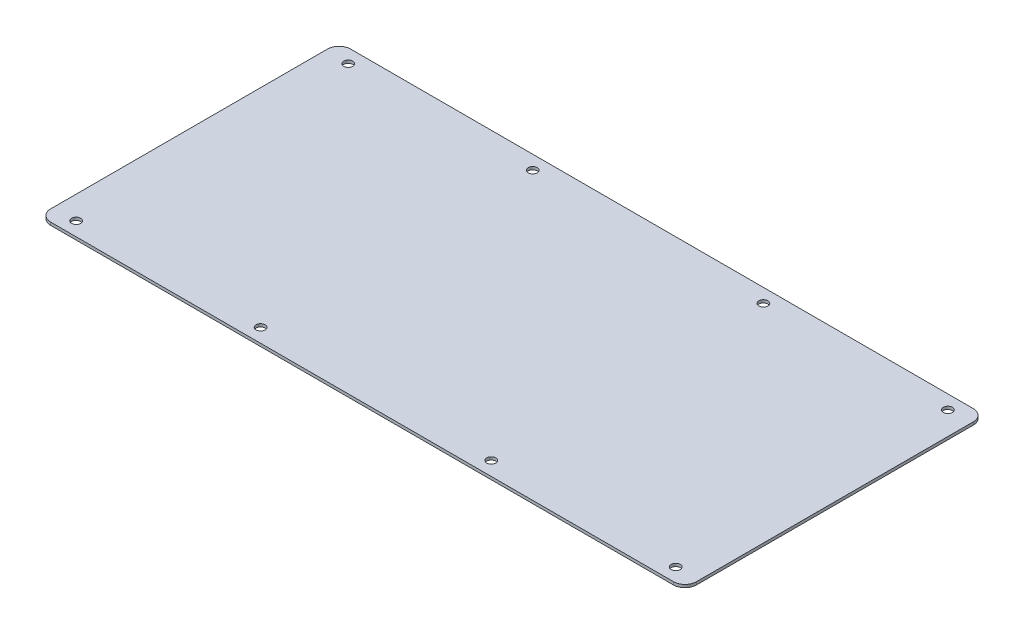
ISO-10303-21;
HEADER;
FILE_DESCRIPTION(('STEP AP214'),'2;1');
FILE_NAME('part.step','',(''),(''),'','','');
FILE_SCHEMA(('AUTOMOTIVE_DESIGN { 1 0 10303 214 1 1 1 1 }'));
ENDSEC;
DATA;
#1=APPLICATION_CONTEXT('core data for automotive mechanical design processes');
#2=APPLICATION_PROTOCOL_DEFINITION('international standard','automotive_design',2000,#1);
#3=PRODUCT_CONTEXT('',#1,'mechanical');
#4=PRODUCT('Part','Part','',(#3));
#5=PRODUCT_RELATED_PRODUCT_CATEGORY('part','',(#4));
#6=PRODUCT_DEFINITION_FORMATION('','',#4);
#7=PRODUCT_DEFINITION_CONTEXT('part definition',#1,'design');
#8=PRODUCT_DEFINITION('design','',#6,#7);
#9=PRODUCT_DEFINITION_SHAPE('','',#8);
#10=(LENGTH_UNIT() NAMED_UNIT(*) SI_UNIT(.MILLI.,.METRE.));
#11=(NAMED_UNIT(*) PLANE_ANGLE_UNIT() SI_UNIT($,.RADIAN.));
#12=(NAMED_UNIT(*) SI_UNIT($,.STERADIAN.) SOLID_ANGLE_UNIT());
#13=UNCERTAINTY_MEASURE_WITH_UNIT(LENGTH_MEASURE(1.E-05),#10,'distance_accuracy_value','');
#14=(GEOMETRIC_REPRESENTATION_CONTEXT(3) GLOBAL_UNCERTAINTY_ASSIGNED_CONTEXT((#13)) GLOBAL_UNIT_ASSIGNED_CONTEXT((#10,
#11,#12)) REPRESENTATION_CONTEXT('',''));
#15=CARTESIAN_POINT('',(0.,0.,0.));
#16=DIRECTION('',(0.,0.,1.));
#17=DIRECTION('',(1.,0.,0.));
#18=AXIS2_PLACEMENT_3D('',#15,#16,#17);
#19=CARTESIAN_POINT('',(0.,1.5875,0.));
#20=DIRECTION('',(1.,0.,0.));
#21=DIRECTION('',(0.,0.,-1.));
#22=AXIS2_PLACEMENT_3D('',#19,#20,#21);
#23=PLANE('',#22);
#24=DIRECTION('',(0.,0.,1.));
#25=VECTOR('',#24,1.);
#26=CARTESIAN_POINT('',(0.,1.5875,0.));
#27=LINE('',#26,#25);
#28=CARTESIAN_POINT('',(0.,1.5875,-158.75));
#29=VERTEX_POINT('',#28);
#30=CARTESIAN_POINT('',(0.,1.5875,-6.35));
#31=VERTEX_POINT('',#30);
#32=EDGE_CURVE('E118',#29,#31,#27,.T.);
#33=ORIENTED_EDGE('',*,*,#32,.F.);
#34=DIRECTION('',(0.,-1.,0.));
#35=VECTOR('',#34,1.);
#36=CARTESIAN_POINT('',(0.,1.5875,-158.75));
#37=LINE('',#36,#35);
#38=CARTESIAN_POINT('',(0.,0.,-158.75));
#39=VERTEX_POINT('',#38);
#40=EDGE_CURVE('E103',#29,#39,#37,.T.);
#41=ORIENTED_EDGE('',*,*,#40,.T.);
#42=DIRECTION('',(0.,0.,1.));
#43=VECTOR('',#42,1.);
#44=CARTESIAN_POINT('',(0.,0.,0.));
#45=LINE('',#44,#43);
#46=CARTESIAN_POINT('',(0.,0.,-6.35));
#47=VERTEX_POINT('',#46);
#48=EDGE_CURVE('E115',#39,#47,#45,.T.);
#49=ORIENTED_EDGE('',*,*,#48,.T.);
#50=DIRECTION('',(0.,-1.,0.));
#51=VECTOR('',#50,1.);
#52=CARTESIAN_POINT('',(0.,1.5875,-6.35));
#53=LINE('',#52,#51);
#54=EDGE_CURVE('E120',#47,#31,#53,.F.);
#55=ORIENTED_EDGE('',*,*,#54,.T.);
#56=EDGE_LOOP('',(#33,#41,#49,#55));
#57=FACE_BOUND('',#56,.T.);
#58=ADVANCED_FACE('F33',(#57),#23,.F.);
#59=CARTESIAN_POINT('',(0.,1.5875,0.));
#60=DIRECTION('',(0.,0.,-1.));
#61=DIRECTION('',(-1.,0.,0.));
#62=AXIS2_PLACEMENT_3D('',#59,#60,#61);
#63=PLANE('',#62);
#64=DIRECTION('',(1.,0.,0.));
#65=VECTOR('',#64,1.);
#66=CARTESIAN_POINT('',(0.,0.,0.));
#67=LINE('',#66,#65);
#68=CARTESIAN_POINT('',(6.35,0.,0.));
#69=VERTEX_POINT('',#68);
#70=CARTESIAN_POINT('',(349.25,0.,0.));
#71=VERTEX_POINT('',#70);
#72=EDGE_CURVE('E124',#69,#71,#67,.T.);
#73=ORIENTED_EDGE('',*,*,#72,.T.);
#74=DIRECTION('',(0.,-1.,0.));
#75=VECTOR('',#74,1.);
#76=CARTESIAN_POINT('',(349.25,1.5875,0.));
#77=LINE('',#76,#75);
#78=CARTESIAN_POINT('',(349.25,1.5875,0.));
#79=VERTEX_POINT('',#78);
#80=EDGE_CURVE('E11',#71,#79,#77,.F.);
#81=ORIENTED_EDGE('',*,*,#80,.T.);
#82=DIRECTION('',(1.,0.,0.));
#83=VECTOR('',#82,1.);
#84=CARTESIAN_POINT('',(0.,1.5875,0.));
#85=LINE('',#84,#83);
#86=CARTESIAN_POINT('',(6.35,1.5875,0.));
#87=VERTEX_POINT('',#86);
#88=EDGE_CURVE('E164',#87,#79,#85,.T.);
#89=ORIENTED_EDGE('',*,*,#88,.F.);
#90=DIRECTION('',(0.,-1.,0.));
#91=VECTOR('',#90,1.);
#92=CARTESIAN_POINT('',(6.35,1.5875,0.));
#93=LINE('',#92,#91);
#94=EDGE_CURVE('E41',#87,#69,#93,.T.);
#95=ORIENTED_EDGE('',*,*,#94,.T.);
#96=EDGE_LOOP('',(#73,#81,#89,#95));
#97=FACE_BOUND('',#96,.T.);
#98=ADVANCED_FACE('F162',(#97),#63,.F.);
#99=CARTESIAN_POINT('',(355.6,1.5875,0.));
#100=DIRECTION('',(-1.,0.,0.));
#101=DIRECTION('',(0.,0.,1.));
#102=AXIS2_PLACEMENT_3D('',#99,#100,#101);
#103=PLANE('',#102);
#104=DIRECTION('',(0.,0.,-1.));
#105=VECTOR('',#104,1.);
#106=CARTESIAN_POINT('',(355.6,0.,0.));
#107=LINE('',#106,#105);
#108=CARTESIAN_POINT('',(355.6,0.,-6.35));
#109=VERTEX_POINT('',#108);
#110=CARTESIAN_POINT('',(355.6,0.,-158.75));
#111=VERTEX_POINT('',#110);
#112=EDGE_CURVE('E128',#109,#111,#107,.T.);
#113=ORIENTED_EDGE('',*,*,#112,.T.);
#114=DIRECTION('',(0.,-1.,0.));
#115=VECTOR('',#114,1.);
#116=CARTESIAN_POINT('',(355.6,1.5875,-158.75));
#117=LINE('',#116,#115);
#118=CARTESIAN_POINT('',(355.6,1.5875,-158.75));
#119=VERTEX_POINT('',#118);
#120=EDGE_CURVE('E48',#111,#119,#117,.F.);
#121=ORIENTED_EDGE('',*,*,#120,.T.);
#122=DIRECTION('',(0.,0.,-1.));
#123=VECTOR('',#122,1.);
#124=CARTESIAN_POINT('',(355.6,1.5875,0.));
#125=LINE('',#124,#123);
#126=CARTESIAN_POINT('',(355.6,1.5875,-6.35));
#127=VERTEX_POINT('',#126);
#128=EDGE_CURVE('E172',#127,#119,#125,.T.);
#129=ORIENTED_EDGE('',*,*,#128,.F.);
#130=DIRECTION('',(0.,-1.,0.));
#131=VECTOR('',#130,1.);
#132=CARTESIAN_POINT('',(355.6,1.5875,-6.35));
#133=LINE('',#132,#131);
#134=EDGE_CURVE('E155',#127,#109,#133,.T.);
#135=ORIENTED_EDGE('',*,*,#134,.T.);
#136=EDGE_LOOP('',(#113,#121,#129,#135));
#137=FACE_BOUND('',#136,.T.);
#138=ADVANCED_FACE('F171',(#137),#103,.F.);
#139=CARTESIAN_POINT('',(0.,1.5875,-165.1));
#140=DIRECTION('',(0.,0.,1.));
#141=DIRECTION('',(1.,0.,0.));
#142=AXIS2_PLACEMENT_3D('',#139,#140,#141);
#143=PLANE('',#142);
#144=DIRECTION('',(-1.,0.,0.));
#145=VECTOR('',#144,1.);
#146=CARTESIAN_POINT('',(0.,0.,-165.1));
#147=LINE('',#146,#145);
#148=CARTESIAN_POINT('',(349.25,0.,-165.1));
#149=VERTEX_POINT('',#148);
#150=CARTESIAN_POINT('',(6.35,0.,-165.1));
#151=VERTEX_POINT('',#150);
#152=EDGE_CURVE('E138',#149,#151,#147,.T.);
#153=ORIENTED_EDGE('',*,*,#152,.T.);
#154=DIRECTION('',(0.,-1.,0.));
#155=VECTOR('',#154,1.);
#156=CARTESIAN_POINT('',(6.35,1.5875,-165.1));
#157=LINE('',#156,#155);
#158=CARTESIAN_POINT('',(6.35,1.5875,-165.1));
#159=VERTEX_POINT('',#158);
#160=EDGE_CURVE('E104',#151,#159,#157,.F.);
#161=ORIENTED_EDGE('',*,*,#160,.T.);
#162=DIRECTION('',(-1.,0.,0.));
#163=VECTOR('',#162,1.);
#164=CARTESIAN_POINT('',(0.,1.5875,-165.1));
#165=LINE('',#164,#163);
#166=CARTESIAN_POINT('',(349.25,1.5875,-165.1));
#167=VERTEX_POINT('',#166);
#168=EDGE_CURVE('E134',#167,#159,#165,.T.);
#169=ORIENTED_EDGE('',*,*,#168,.F.);
#170=DIRECTION('',(0.,-1.,0.));
#171=VECTOR('',#170,1.);
#172=CARTESIAN_POINT('',(349.25,1.5875,-165.1));
#173=LINE('',#172,#171);
#174=EDGE_CURVE('E109',#167,#149,#173,.T.);
#175=ORIENTED_EDGE('',*,*,#174,.T.);
#176=EDGE_LOOP('',(#153,#161,#169,#175));
#177=FACE_BOUND('',#176,.T.);
#178=ADVANCED_FACE('F236',(#177),#143,.F.);
#179=CARTESIAN_POINT('',(0.,1.5875,0.));
#180=DIRECTION('',(0.,-1.,0.));
#181=DIRECTION('',(0.,0.,-1.));
#182=AXIS2_PLACEMENT_3D('',#179,#180,#181);
#183=PLANE('',#182);
#184=CARTESIAN_POINT('',(114.3,1.5875,-7.62));
#185=DIRECTION('',(0.,1.,0.));
#186=DIRECTION('',(0.,0.,1.));
#187=AXIS2_PLACEMENT_3D('',#184,#185,#186);
#188=CIRCLE('',#187,2.4892);
#189=CARTESIAN_POINT('',(114.3,1.5875,-5.13079999999999));
#190=VERTEX_POINT('',#189);
#191=EDGE_CURVE('E193',#190,#190,#188,.T.);
#192=ORIENTED_EDGE('',*,*,#191,.F.);
#193=EDGE_LOOP('',(#192));
#194=FACE_BOUND('',#193,.T.);
#195=CARTESIAN_POINT('',(241.3,1.5875,-7.62));
#196=DIRECTION('',(0.,1.,0.));
#197=DIRECTION('',(0.,0.,1.));
#198=AXIS2_PLACEMENT_3D('',#195,#196,#197);
#199=CIRCLE('',#198,2.4892);
#200=CARTESIAN_POINT('',(241.3,1.5875,-5.1308));
#201=VERTEX_POINT('',#200);
#202=EDGE_CURVE('E200',#201,#201,#199,.T.);
#203=ORIENTED_EDGE('',*,*,#202,.F.);
#204=EDGE_LOOP('',(#203));
#205=FACE_BOUND('',#204,.T.);
#206=CARTESIAN_POINT('',(241.3,1.5875,-157.48));
#207=DIRECTION('',(0.,1.,0.));
#208=DIRECTION('',(0.,0.,-1.));
#209=AXIS2_PLACEMENT_3D('',#206,#207,#208);
#210=CIRCLE('',#209,2.4892);
#211=CARTESIAN_POINT('',(241.3,1.5875,-159.9692));
#212=VERTEX_POINT('',#211);
#213=EDGE_CURVE('E181',#212,#212,#210,.T.);
#214=ORIENTED_EDGE('',*,*,#213,.F.);
#215=EDGE_LOOP('',(#214));
#216=FACE_BOUND('',#215,.T.);
#217=CARTESIAN_POINT('',(342.9,1.5875,-7.62));
#218=DIRECTION('',(0.,1.,0.));
#219=DIRECTION('',(0.,0.,1.));
#220=AXIS2_PLACEMENT_3D('',#217,#218,#219);
#221=CIRCLE('',#220,2.48919999999995);
#222=CARTESIAN_POINT('',(342.9,1.5875,-5.13080000000005));
#223=VERTEX_POINT('',#222);
#224=EDGE_CURVE('E188',#223,#223,#221,.T.);
#225=ORIENTED_EDGE('',*,*,#224,.F.);
#226=EDGE_LOOP('',(#225));
#227=FACE_BOUND('',#226,.T.);
#228=CARTESIAN_POINT('',(114.3,1.5875,-157.48));
#229=DIRECTION('',(0.,1.,0.));
#230=DIRECTION('',(0.,0.,-1.));
#231=AXIS2_PLACEMENT_3D('',#228,#229,#230);
#232=CIRCLE('',#231,2.48920000000001);
#233=CARTESIAN_POINT('',(114.3,1.5875,-159.9692));
#234=VERTEX_POINT('',#233);
#235=EDGE_CURVE('E217',#234,#234,#232,.T.);
#236=ORIENTED_EDGE('',*,*,#235,.F.);
#237=EDGE_LOOP('',(#236));
#238=FACE_BOUND('',#237,.T.);
#239=CARTESIAN_POINT('',(342.9,1.5875,-157.48));
#240=DIRECTION('',(0.,1.,0.));
#241=DIRECTION('',(0.,0.,-1.));
#242=AXIS2_PLACEMENT_3D('',#239,#240,#241);
#243=CIRCLE('',#242,2.48919999999995);
#244=CARTESIAN_POINT('',(342.9,1.5875,-159.9692));
#245=VERTEX_POINT('',#244);
#246=EDGE_CURVE('E211',#245,#245,#243,.T.);
#247=ORIENTED_EDGE('',*,*,#246,.F.);
#248=EDGE_LOOP('',(#247));
#249=FACE_BOUND('',#248,.T.);
#250=CARTESIAN_POINT('',(12.7,1.5875,-157.48));
#251=DIRECTION('',(0.,1.,0.));
#252=DIRECTION('',(0.,0.,-1.));
#253=AXIS2_PLACEMENT_3D('',#250,#251,#252);
#254=CIRCLE('',#253,2.4892);
#255=CARTESIAN_POINT('',(12.7,1.5875,-159.9692));
#256=VERTEX_POINT('',#255);
#257=EDGE_CURVE('E205',#256,#256,#254,.T.);
#258=ORIENTED_EDGE('',*,*,#257,.F.);
#259=EDGE_LOOP('',(#258));
#260=FACE_BOUND('',#259,.T.);
#261=CARTESIAN_POINT('',(12.7,1.5875,-7.61999999999999));
#262=DIRECTION('',(0.,1.,0.));
#263=DIRECTION('',(0.,0.,1.));
#264=AXIS2_PLACEMENT_3D('',#261,#262,#263);
#265=CIRCLE('',#264,2.4892);
#266=CARTESIAN_POINT('',(12.7,1.5875,-5.13079999999999));
#267=VERTEX_POINT('',#266);
#268=EDGE_CURVE('E131',#267,#267,#265,.T.);
#269=ORIENTED_EDGE('',*,*,#268,.F.);
#270=EDGE_LOOP('',(#269));
#271=FACE_BOUND('',#270,.T.);
#272=ORIENTED_EDGE('',*,*,#168,.T.);
#273=CARTESIAN_POINT('',(6.35,1.5875,-158.75));
#274=DIRECTION('',(0.,-1.,0.));
#275=DIRECTION('',(0.,0.,-1.));
#276=AXIS2_PLACEMENT_3D('',#273,#274,#275);
#277=CIRCLE('',#276,6.35);
#278=EDGE_CURVE('E153',#159,#29,#277,.F.);
#279=ORIENTED_EDGE('',*,*,#278,.T.);
#280=ORIENTED_EDGE('',*,*,#32,.T.);
#281=CARTESIAN_POINT('',(6.35,1.5875,-6.35));
#282=DIRECTION('',(0.,-1.,0.));
#283=DIRECTION('',(0.,0.,-1.));
#284=AXIS2_PLACEMENT_3D('',#281,#282,#283);
#285=CIRCLE('',#284,6.35);
#286=EDGE_CURVE('E148',#31,#87,#285,.F.);
#287=ORIENTED_EDGE('',*,*,#286,.T.);
#288=ORIENTED_EDGE('',*,*,#88,.T.);
#289=CARTESIAN_POINT('',(349.25,1.5875,-6.35));
#290=DIRECTION('',(0.,-1.,0.));
#291=DIRECTION('',(0.,0.,-1.));
#292=AXIS2_PLACEMENT_3D('',#289,#290,#291);
#293=CIRCLE('',#292,6.35);
#294=EDGE_CURVE('E55',#79,#127,#293,.F.);
#295=ORIENTED_EDGE('',*,*,#294,.T.);
#296=ORIENTED_EDGE('',*,*,#128,.T.);
#297=CARTESIAN_POINT('',(349.25,1.5875,-158.75));
#298=DIRECTION('',(0.,-1.,0.));
#299=DIRECTION('',(0.,0.,-1.));
#300=AXIS2_PLACEMENT_3D('',#297,#298,#299);
#301=CIRCLE('',#300,6.35);
#302=EDGE_CURVE('E151',#119,#167,#301,.F.);
#303=ORIENTED_EDGE('',*,*,#302,.T.);
#304=EDGE_LOOP('',(#272,#279,#280,#287,#288,#295,#296,#303));
#305=FACE_BOUND('',#304,.T.);
#306=ADVANCED_FACE('F233',(#194,#205,#216,#227,#238,#249,#260,#271,#305),#183,.F.);
#307=CARTESIAN_POINT('',(0.,0.,0.));
#308=DIRECTION('',(0.,-1.,0.));
#309=DIRECTION('',(0.,0.,-1.));
#310=AXIS2_PLACEMENT_3D('',#307,#308,#309);
#311=PLANE('',#310);
#312=CARTESIAN_POINT('',(114.3,0.,-7.62));
#313=DIRECTION('',(0.,1.,0.));
#314=DIRECTION('',(0.,0.,1.));
#315=AXIS2_PLACEMENT_3D('',#312,#313,#314);
#316=CIRCLE('',#315,2.4892);
#317=CARTESIAN_POINT('',(114.3,0.,-5.13079999999999));
#318=VERTEX_POINT('',#317);
#319=EDGE_CURVE('E196',#318,#318,#316,.T.);
#320=ORIENTED_EDGE('',*,*,#319,.T.);
#321=EDGE_LOOP('',(#320));
#322=FACE_BOUND('',#321,.T.);
#323=CARTESIAN_POINT('',(241.3,0.,-7.62));
#324=DIRECTION('',(0.,1.,0.));
#325=DIRECTION('',(0.,0.,1.));
#326=AXIS2_PLACEMENT_3D('',#323,#324,#325);
#327=CIRCLE('',#326,2.4892);
#328=CARTESIAN_POINT('',(241.3,0.,-5.1308));
#329=VERTEX_POINT('',#328);
#330=EDGE_CURVE('E185',#329,#329,#327,.T.);
#331=ORIENTED_EDGE('',*,*,#330,.T.);
#332=EDGE_LOOP('',(#331));
#333=FACE_BOUND('',#332,.T.);
#334=CARTESIAN_POINT('',(241.3,0.,-157.48));
#335=DIRECTION('',(0.,1.,0.));
#336=DIRECTION('',(0.,0.,-1.));
#337=AXIS2_PLACEMENT_3D('',#334,#335,#336);
#338=CIRCLE('',#337,2.4892);
#339=CARTESIAN_POINT('',(241.3,0.,-159.9692));
#340=VERTEX_POINT('',#339);
#341=EDGE_CURVE('E184',#340,#340,#338,.T.);
#342=ORIENTED_EDGE('',*,*,#341,.T.);
#343=EDGE_LOOP('',(#342));
#344=FACE_BOUND('',#343,.T.);
#345=CARTESIAN_POINT('',(342.9,0.,-7.62));
#346=DIRECTION('',(0.,1.,0.));
#347=DIRECTION('',(0.,0.,1.));
#348=AXIS2_PLACEMENT_3D('',#345,#346,#347);
#349=CIRCLE('',#348,2.48919999999995);
#350=CARTESIAN_POINT('',(342.9,0.,-5.13080000000005));
#351=VERTEX_POINT('',#350);
#352=EDGE_CURVE('E179',#351,#351,#349,.T.);
#353=ORIENTED_EDGE('',*,*,#352,.T.);
#354=EDGE_LOOP('',(#353));
#355=FACE_BOUND('',#354,.T.);
#356=CARTESIAN_POINT('',(114.3,0.,-157.48));
#357=DIRECTION('',(0.,1.,0.));
#358=DIRECTION('',(0.,0.,-1.));
#359=AXIS2_PLACEMENT_3D('',#356,#357,#358);
#360=CIRCLE('',#359,2.48920000000001);
#361=CARTESIAN_POINT('',(114.3,0.,-159.9692));
#362=VERTEX_POINT('',#361);
#363=EDGE_CURVE('E197',#362,#362,#360,.T.);
#364=ORIENTED_EDGE('',*,*,#363,.T.);
#365=EDGE_LOOP('',(#364));
#366=FACE_BOUND('',#365,.T.);
#367=CARTESIAN_POINT('',(342.9,0.,-157.48));
#368=DIRECTION('',(0.,1.,0.));
#369=DIRECTION('',(0.,0.,-1.));
#370=AXIS2_PLACEMENT_3D('',#367,#368,#369);
#371=CIRCLE('',#370,2.48919999999995);
#372=CARTESIAN_POINT('',(342.9,0.,-159.9692));
#373=VERTEX_POINT('',#372);
#374=EDGE_CURVE('E214',#373,#373,#371,.T.);
#375=ORIENTED_EDGE('',*,*,#374,.T.);
#376=EDGE_LOOP('',(#375));
#377=FACE_BOUND('',#376,.T.);
#378=CARTESIAN_POINT('',(12.7,0.,-157.48));
#379=DIRECTION('',(0.,1.,0.));
#380=DIRECTION('',(0.,0.,-1.));
#381=AXIS2_PLACEMENT_3D('',#378,#379,#380);
#382=CIRCLE('',#381,2.4892);
#383=CARTESIAN_POINT('',(12.7,0.,-159.9692));
#384=VERTEX_POINT('',#383);
#385=EDGE_CURVE('E208',#384,#384,#382,.T.);
#386=ORIENTED_EDGE('',*,*,#385,.T.);
#387=EDGE_LOOP('',(#386));
#388=FACE_BOUND('',#387,.T.);
#389=CARTESIAN_POINT('',(12.7,0.,-7.61999999999999));
#390=DIRECTION('',(0.,1.,0.));
#391=DIRECTION('',(0.,0.,1.));
#392=AXIS2_PLACEMENT_3D('',#389,#390,#391);
#393=CIRCLE('',#392,2.4892);
#394=CARTESIAN_POINT('',(12.7,0.,-5.13079999999999));
#395=VERTEX_POINT('',#394);
#396=EDGE_CURVE('E125',#395,#395,#393,.T.);
#397=ORIENTED_EDGE('',*,*,#396,.T.);
#398=EDGE_LOOP('',(#397));
#399=FACE_BOUND('',#398,.T.);
#400=ORIENTED_EDGE('',*,*,#48,.F.);
#401=CARTESIAN_POINT('',(6.35,0.,-158.75));
#402=DIRECTION('',(0.,-1.,0.));
#403=DIRECTION('',(0.,0.,-1.));
#404=AXIS2_PLACEMENT_3D('',#401,#402,#403);
#405=CIRCLE('',#404,6.35);
#406=EDGE_CURVE('E99',#39,#151,#405,.T.);
#407=ORIENTED_EDGE('',*,*,#406,.T.);
#408=ORIENTED_EDGE('',*,*,#152,.F.);
#409=CARTESIAN_POINT('',(349.25,0.,-158.75));
#410=DIRECTION('',(0.,-1.,0.));
#411=DIRECTION('',(0.,0.,-1.));
#412=AXIS2_PLACEMENT_3D('',#409,#410,#411);
#413=CIRCLE('',#412,6.35);
#414=EDGE_CURVE('E110',#149,#111,#413,.T.);
#415=ORIENTED_EDGE('',*,*,#414,.T.);
#416=ORIENTED_EDGE('',*,*,#112,.F.);
#417=CARTESIAN_POINT('',(349.25,0.,-6.35));
#418=DIRECTION('',(0.,-1.,0.));
#419=DIRECTION('',(0.,0.,-1.));
#420=AXIS2_PLACEMENT_3D('',#417,#418,#419);
#421=CIRCLE('',#420,6.35);
#422=EDGE_CURVE('E142',#109,#71,#421,.T.);
#423=ORIENTED_EDGE('',*,*,#422,.T.);
#424=ORIENTED_EDGE('',*,*,#72,.F.);
#425=CARTESIAN_POINT('',(6.35,0.,-6.35));
#426=DIRECTION('',(0.,-1.,0.));
#427=DIRECTION('',(0.,0.,-1.));
#428=AXIS2_PLACEMENT_3D('',#425,#426,#427);
#429=CIRCLE('',#428,6.35);
#430=EDGE_CURVE('E119',#69,#47,#429,.T.);
#431=ORIENTED_EDGE('',*,*,#430,.T.);
#432=EDGE_LOOP('',(#400,#407,#408,#415,#416,#423,#424,#431));
#433=FACE_BOUND('',#432,.T.);
#434=ADVANCED_FACE('F122',(#322,#333,#344,#355,#366,#377,#388,#399,#433),#311,.T.);
#435=CARTESIAN_POINT('',(6.35,1.5875,-158.75));
#436=DIRECTION('',(0.,-1.,0.));
#437=DIRECTION('',(0.,0.,-1.));
#438=AXIS2_PLACEMENT_3D('',#435,#436,#437);
#439=CYLINDRICAL_SURFACE('',#438,6.35);
#440=ORIENTED_EDGE('',*,*,#278,.F.);
#441=ORIENTED_EDGE('',*,*,#160,.F.);
#442=ORIENTED_EDGE('',*,*,#406,.F.);
#443=ORIENTED_EDGE('',*,*,#40,.F.);
#444=EDGE_LOOP('',(#440,#441,#442,#443));
#445=FACE_BOUND('',#444,.T.);
#446=ADVANCED_FACE('F102',(#445),#439,.T.);
#447=CARTESIAN_POINT('',(349.25,1.5875,-158.75));
#448=DIRECTION('',(0.,-1.,0.));
#449=DIRECTION('',(0.,0.,-1.));
#450=AXIS2_PLACEMENT_3D('',#447,#448,#449);
#451=CYLINDRICAL_SURFACE('',#450,6.35);
#452=ORIENTED_EDGE('',*,*,#302,.F.);
#453=ORIENTED_EDGE('',*,*,#120,.F.);
#454=ORIENTED_EDGE('',*,*,#414,.F.);
#455=ORIENTED_EDGE('',*,*,#174,.F.);
#456=EDGE_LOOP('',(#452,#453,#454,#455));
#457=FACE_BOUND('',#456,.T.);
#458=ADVANCED_FACE('F248',(#457),#451,.T.);
#459=CARTESIAN_POINT('',(349.25,1.5875,-6.35));
#460=DIRECTION('',(0.,-1.,0.));
#461=DIRECTION('',(0.,0.,-1.));
#462=AXIS2_PLACEMENT_3D('',#459,#460,#461);
#463=CYLINDRICAL_SURFACE('',#462,6.35);
#464=ORIENTED_EDGE('',*,*,#294,.F.);
#465=ORIENTED_EDGE('',*,*,#80,.F.);
#466=ORIENTED_EDGE('',*,*,#422,.F.);
#467=ORIENTED_EDGE('',*,*,#134,.F.);
#468=EDGE_LOOP('',(#464,#465,#466,#467));
#469=FACE_BOUND('',#468,.T.);
#470=ADVANCED_FACE('F170',(#469),#463,.T.);
#471=CARTESIAN_POINT('',(6.35,1.5875,-6.35));
#472=DIRECTION('',(0.,-1.,0.));
#473=DIRECTION('',(0.,0.,-1.));
#474=AXIS2_PLACEMENT_3D('',#471,#472,#473);
#475=CYLINDRICAL_SURFACE('',#474,6.35);
#476=ORIENTED_EDGE('',*,*,#286,.F.);
#477=ORIENTED_EDGE('',*,*,#54,.F.);
#478=ORIENTED_EDGE('',*,*,#430,.F.);
#479=ORIENTED_EDGE('',*,*,#94,.F.);
#480=EDGE_LOOP('',(#476,#477,#478,#479));
#481=FACE_BOUND('',#480,.T.);
#482=ADVANCED_FACE('F35',(#481),#475,.T.);
#483=CARTESIAN_POINT('',(12.7,0.,-7.61999999999999));
#484=DIRECTION('',(0.,1.,0.));
#485=DIRECTION('',(0.,0.,1.));
#486=AXIS2_PLACEMENT_3D('',#483,#484,#485);
#487=CYLINDRICAL_SURFACE('',#486,2.4892);
#488=ORIENTED_EDGE('',*,*,#396,.F.);
#489=EDGE_LOOP('',(#488));
#490=FACE_BOUND('',#489,.T.);
#491=ORIENTED_EDGE('',*,*,#268,.T.);
#492=EDGE_LOOP('',(#491));
#493=FACE_BOUND('',#492,.T.);
#494=ADVANCED_FACE('F270',(#490,#493),#487,.F.);
#495=CARTESIAN_POINT('',(12.7,0.,-157.48));
#496=DIRECTION('',(0.,1.,0.));
#497=DIRECTION('',(0.,0.,1.));
#498=AXIS2_PLACEMENT_3D('',#495,#496,#497);
#499=CYLINDRICAL_SURFACE('',#498,2.4892);
#500=ORIENTED_EDGE('',*,*,#385,.F.);
#501=EDGE_LOOP('',(#500));
#502=FACE_BOUND('',#501,.T.);
#503=ORIENTED_EDGE('',*,*,#257,.T.);
#504=EDGE_LOOP('',(#503));
#505=FACE_BOUND('',#504,.T.);
#506=ADVANCED_FACE('F273',(#502,#505),#499,.F.);
#507=CARTESIAN_POINT('',(342.9,0.,-157.48));
#508=DIRECTION('',(0.,1.,0.));
#509=DIRECTION('',(0.,0.,1.));
#510=AXIS2_PLACEMENT_3D('',#507,#508,#509);
#511=CYLINDRICAL_SURFACE('',#510,2.48919999999995);
#512=ORIENTED_EDGE('',*,*,#374,.F.);
#513=EDGE_LOOP('',(#512));
#514=FACE_BOUND('',#513,.T.);
#515=ORIENTED_EDGE('',*,*,#246,.T.);
#516=EDGE_LOOP('',(#515));
#517=FACE_BOUND('',#516,.T.);
#518=ADVANCED_FACE('F229',(#514,#517),#511,.F.);
#519=CARTESIAN_POINT('',(114.3,0.,-157.48));
#520=DIRECTION('',(0.,1.,0.));
#521=DIRECTION('',(0.,0.,1.));
#522=AXIS2_PLACEMENT_3D('',#519,#520,#521);
#523=CYLINDRICAL_SURFACE('',#522,2.48920000000001);
#524=ORIENTED_EDGE('',*,*,#363,.F.);
#525=EDGE_LOOP('',(#524));
#526=FACE_BOUND('',#525,.T.);
#527=ORIENTED_EDGE('',*,*,#235,.T.);
#528=EDGE_LOOP('',(#527));
#529=FACE_BOUND('',#528,.T.);
#530=ADVANCED_FACE('F225',(#526,#529),#523,.F.);
#531=CARTESIAN_POINT('',(342.9,0.,-7.62));
#532=DIRECTION('',(0.,1.,0.));
#533=DIRECTION('',(0.,0.,1.));
#534=AXIS2_PLACEMENT_3D('',#531,#532,#533);
#535=CYLINDRICAL_SURFACE('',#534,2.48919999999995);
#536=ORIENTED_EDGE('',*,*,#352,.F.);
#537=EDGE_LOOP('',(#536));
#538=FACE_BOUND('',#537,.T.);
#539=ORIENTED_EDGE('',*,*,#224,.T.);
#540=EDGE_LOOP('',(#539));
#541=FACE_BOUND('',#540,.T.);
#542=ADVANCED_FACE('F228',(#538,#541),#535,.F.);
#543=CARTESIAN_POINT('',(241.3,0.,-157.48));
#544=DIRECTION('',(0.,1.,0.));
#545=DIRECTION('',(0.,0.,1.));
#546=AXIS2_PLACEMENT_3D('',#543,#544,#545);
#547=CYLINDRICAL_SURFACE('',#546,2.4892);
#548=ORIENTED_EDGE('',*,*,#341,.F.);
#549=EDGE_LOOP('',(#548));
#550=FACE_BOUND('',#549,.T.);
#551=ORIENTED_EDGE('',*,*,#213,.T.);
#552=EDGE_LOOP('',(#551));
#553=FACE_BOUND('',#552,.T.);
#554=ADVANCED_FACE('F275',(#550,#553),#547,.F.);
#555=CARTESIAN_POINT('',(241.3,0.,-7.62));
#556=DIRECTION('',(0.,1.,0.));
#557=DIRECTION('',(0.,0.,1.));
#558=AXIS2_PLACEMENT_3D('',#555,#556,#557);
#559=CYLINDRICAL_SURFACE('',#558,2.4892);
#560=ORIENTED_EDGE('',*,*,#330,.F.);
#561=EDGE_LOOP('',(#560));
#562=FACE_BOUND('',#561,.T.);
#563=ORIENTED_EDGE('',*,*,#202,.T.);
#564=EDGE_LOOP('',(#563));
#565=FACE_BOUND('',#564,.T.);
#566=ADVANCED_FACE('F278',(#562,#565),#559,.F.);
#567=CARTESIAN_POINT('',(114.3,0.,-7.62));
#568=DIRECTION('',(0.,1.,0.));
#569=DIRECTION('',(0.,0.,1.));
#570=AXIS2_PLACEMENT_3D('',#567,#568,#569);
#571=CYLINDRICAL_SURFACE('',#570,2.4892);
#572=ORIENTED_EDGE('',*,*,#319,.F.);
#573=EDGE_LOOP('',(#572));
#574=FACE_BOUND('',#573,.T.);
#575=ORIENTED_EDGE('',*,*,#191,.T.);
#576=EDGE_LOOP('',(#575));
#577=FACE_BOUND('',#576,.T.);
#578=ADVANCED_FACE('F283',(#574,#577),#571,.F.);
#579=CLOSED_SHELL('',(#58,#98,#138,#178,#306,#434,#446,#458,#470,#482,#494,#506,#518,#530,#542,
#554,#566,#578));
#580=MANIFOLD_SOLID_BREP('B2',#579);
#581=ADVANCED_BREP_SHAPE_REPRESENTATION('',(#18,#580),#14);
#582=SHAPE_DEFINITION_REPRESENTATION(#9,#581);
ENDSEC;
END-ISO-10303-21;
